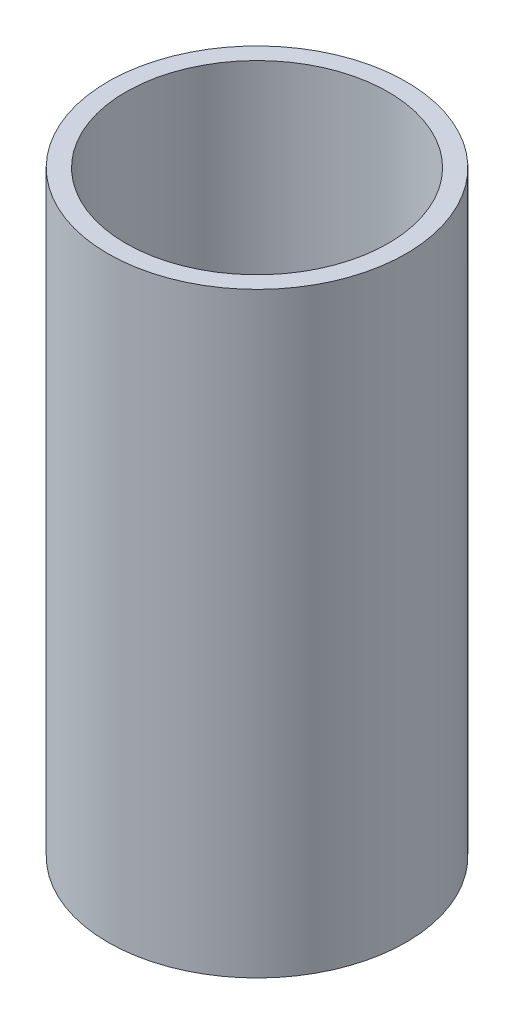
ISO-10303-21;
HEADER;
FILE_DESCRIPTION(('STEP AP214'),'2;1');
FILE_NAME('part.step','',(''),(''),'','','');
FILE_SCHEMA(('AUTOMOTIVE_DESIGN { 1 0 10303 214 1 1 1 1 }'));
ENDSEC;
DATA;
#1=APPLICATION_CONTEXT('core data for automotive mechanical design processes');
#2=APPLICATION_PROTOCOL_DEFINITION('international standard','automotive_design',2000,#1);
#3=PRODUCT_CONTEXT('',#1,'mechanical');
#4=PRODUCT('Part','Part','',(#3));
#5=PRODUCT_RELATED_PRODUCT_CATEGORY('part','',(#4));
#6=PRODUCT_DEFINITION_FORMATION('','',#4);
#7=PRODUCT_DEFINITION_CONTEXT('part definition',#1,'design');
#8=PRODUCT_DEFINITION('design','',#6,#7);
#9=PRODUCT_DEFINITION_SHAPE('','',#8);
#10=(LENGTH_UNIT() NAMED_UNIT(*) SI_UNIT(.MILLI.,.METRE.));
#11=(NAMED_UNIT(*) PLANE_ANGLE_UNIT() SI_UNIT($,.RADIAN.));
#12=(NAMED_UNIT(*) SI_UNIT($,.STERADIAN.) SOLID_ANGLE_UNIT());
#13=UNCERTAINTY_MEASURE_WITH_UNIT(LENGTH_MEASURE(1.E-05),#10,'distance_accuracy_value','');
#14=(GEOMETRIC_REPRESENTATION_CONTEXT(3) GLOBAL_UNCERTAINTY_ASSIGNED_CONTEXT((#13)) GLOBAL_UNIT_ASSIGNED_CONTEXT((#10,
#11,#12)) REPRESENTATION_CONTEXT('',''));
#15=CARTESIAN_POINT('',(0.,0.,0.));
#16=DIRECTION('',(0.,0.,1.));
#17=DIRECTION('',(1.,0.,0.));
#18=AXIS2_PLACEMENT_3D('',#15,#16,#17);
#19=CARTESIAN_POINT('',(0.,50.8,0.));
#20=DIRECTION('',(0.,1.,0.));
#21=DIRECTION('',(0.,0.,1.));
#22=AXIS2_PLACEMENT_3D('',#19,#20,#21);
#23=PLANE('',#22);
#24=CARTESIAN_POINT('',(0.,50.8,0.));
#25=DIRECTION('',(0.,1.,0.));
#26=DIRECTION('',(0.,0.,1.));
#27=AXIS2_PLACEMENT_3D('',#24,#25,#26);
#28=CIRCLE('',#27,12.7);
#29=CARTESIAN_POINT('',(0.,50.8,12.7));
#30=VERTEX_POINT('',#29);
#31=EDGE_CURVE('E10',#30,#30,#28,.T.);
#32=ORIENTED_EDGE('',*,*,#31,.T.);
#33=EDGE_LOOP('',(#32));
#34=FACE_BOUND('',#33,.T.);
#35=CARTESIAN_POINT('',(0.,50.8,0.));
#36=DIRECTION('',(0.,1.,0.));
#37=DIRECTION('',(0.,0.,1.));
#38=AXIS2_PLACEMENT_3D('',#35,#36,#37);
#39=CIRCLE('',#38,11.176);
#40=CARTESIAN_POINT('',(0.,50.8,11.176));
#41=VERTEX_POINT('',#40);
#42=EDGE_CURVE('E42',#41,#41,#39,.T.);
#43=ORIENTED_EDGE('',*,*,#42,.F.);
#44=EDGE_LOOP('',(#43));
#45=FACE_BOUND('',#44,.T.);
#46=ADVANCED_FACE('F31',(#34,#45),#23,.T.);
#47=CARTESIAN_POINT('',(0.,0.,0.));
#48=DIRECTION('',(0.,1.,0.));
#49=DIRECTION('',(0.,0.,1.));
#50=AXIS2_PLACEMENT_3D('',#47,#48,#49);
#51=PLANE('',#50);
#52=CARTESIAN_POINT('',(0.,0.,0.));
#53=DIRECTION('',(0.,1.,0.));
#54=DIRECTION('',(0.,0.,1.));
#55=AXIS2_PLACEMENT_3D('',#52,#53,#54);
#56=CIRCLE('',#55,12.7);
#57=CARTESIAN_POINT('',(0.,0.,12.7));
#58=VERTEX_POINT('',#57);
#59=EDGE_CURVE('E35',#58,#58,#56,.T.);
#60=ORIENTED_EDGE('',*,*,#59,.F.);
#61=EDGE_LOOP('',(#60));
#62=FACE_BOUND('',#61,.T.);
#63=CARTESIAN_POINT('',(0.,0.,0.));
#64=DIRECTION('',(0.,1.,0.));
#65=DIRECTION('',(0.,0.,1.));
#66=AXIS2_PLACEMENT_3D('',#63,#64,#65);
#67=CIRCLE('',#66,11.176);
#68=CARTESIAN_POINT('',(0.,0.,11.176));
#69=VERTEX_POINT('',#68);
#70=EDGE_CURVE('E44',#69,#69,#67,.T.);
#71=ORIENTED_EDGE('',*,*,#70,.T.);
#72=EDGE_LOOP('',(#71));
#73=FACE_BOUND('',#72,.T.);
#74=ADVANCED_FACE('F54',(#62,#73),#51,.F.);
#75=CARTESIAN_POINT('',(0.,50.8,0.));
#76=DIRECTION('',(0.,-1.,0.));
#77=DIRECTION('',(0.,0.,-1.));
#78=AXIS2_PLACEMENT_3D('',#75,#76,#77);
#79=CYLINDRICAL_SURFACE('',#78,12.7);
#80=ORIENTED_EDGE('',*,*,#31,.F.);
#81=EDGE_LOOP('',(#80));
#82=FACE_BOUND('',#81,.T.);
#83=ORIENTED_EDGE('',*,*,#59,.T.);
#84=EDGE_LOOP('',(#83));
#85=FACE_BOUND('',#84,.T.);
#86=ADVANCED_FACE('F33',(#82,#85),#79,.T.);
#87=CARTESIAN_POINT('',(0.,50.8,0.));
#88=DIRECTION('',(0.,-1.,0.));
#89=DIRECTION('',(0.,0.,-1.));
#90=AXIS2_PLACEMENT_3D('',#87,#88,#89);
#91=CYLINDRICAL_SURFACE('',#90,11.176);
#92=ORIENTED_EDGE('',*,*,#42,.T.);
#93=EDGE_LOOP('',(#92));
#94=FACE_BOUND('',#93,.T.);
#95=ORIENTED_EDGE('',*,*,#70,.F.);
#96=EDGE_LOOP('',(#95));
#97=FACE_BOUND('',#96,.T.);
#98=ADVANCED_FACE('F50',(#94,#97),#91,.F.);
#99=CLOSED_SHELL('',(#46,#74,#86,#98));
#100=MANIFOLD_SOLID_BREP('B2',#99);
#101=ADVANCED_BREP_SHAPE_REPRESENTATION('',(#18,#100),#14);
#102=SHAPE_DEFINITION_REPRESENTATION(#9,#101);
ENDSEC;
END-ISO-10303-21;
